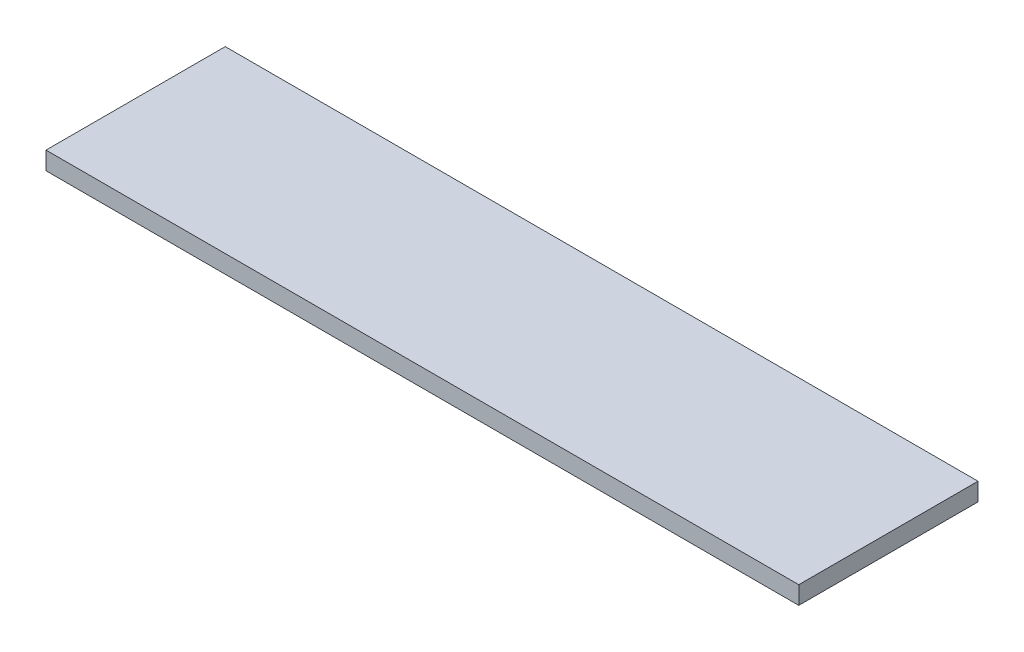
ISO-10303-21;
HEADER;
FILE_DESCRIPTION(('STEP AP214'),'2;1');
FILE_NAME('part.step','',(''),(''),'','','');
FILE_SCHEMA(('AUTOMOTIVE_DESIGN { 1 0 10303 214 1 1 1 1 }'));
ENDSEC;
DATA;
#1=APPLICATION_CONTEXT('core data for automotive mechanical design processes');
#2=APPLICATION_PROTOCOL_DEFINITION('international standard','automotive_design',2000,#1);
#3=PRODUCT_CONTEXT('',#1,'mechanical');
#4=PRODUCT('Part','Part','',(#3));
#5=PRODUCT_RELATED_PRODUCT_CATEGORY('part','',(#4));
#6=PRODUCT_DEFINITION_FORMATION('','',#4);
#7=PRODUCT_DEFINITION_CONTEXT('part definition',#1,'design');
#8=PRODUCT_DEFINITION('design','',#6,#7);
#9=PRODUCT_DEFINITION_SHAPE('','',#8);
#10=(LENGTH_UNIT() NAMED_UNIT(*) SI_UNIT(.MILLI.,.METRE.));
#11=(NAMED_UNIT(*) PLANE_ANGLE_UNIT() SI_UNIT($,.RADIAN.));
#12=(NAMED_UNIT(*) SI_UNIT($,.STERADIAN.) SOLID_ANGLE_UNIT());
#13=UNCERTAINTY_MEASURE_WITH_UNIT(LENGTH_MEASURE(1.E-05),#10,'distance_accuracy_value','');
#14=(GEOMETRIC_REPRESENTATION_CONTEXT(3) GLOBAL_UNCERTAINTY_ASSIGNED_CONTEXT((#13)) GLOBAL_UNIT_ASSIGNED_CONTEXT((#10,
#11,#12)) REPRESENTATION_CONTEXT('',''));
#15=CARTESIAN_POINT('',(0.,0.,0.));
#16=DIRECTION('',(0.,0.,1.));
#17=DIRECTION('',(1.,0.,0.));
#18=AXIS2_PLACEMENT_3D('',#15,#16,#17);
#19=CARTESIAN_POINT('',(0.,1.,0.));
#20=DIRECTION('',(1.,0.,0.));
#21=DIRECTION('',(0.,0.,-1.));
#22=AXIS2_PLACEMENT_3D('',#19,#20,#21);
#23=PLANE('',#22);
#24=DIRECTION('',(0.,0.,1.));
#25=VECTOR('',#24,1.);
#26=CARTESIAN_POINT('',(0.,0.,0.));
#27=LINE('',#26,#25);
#28=CARTESIAN_POINT('',(0.,0.,-10.));
#29=VERTEX_POINT('',#28);
#30=CARTESIAN_POINT('',(0.,0.,0.));
#31=VERTEX_POINT('',#30);
#32=EDGE_CURVE('E97',#29,#31,#27,.T.);
#33=ORIENTED_EDGE('',*,*,#32,.T.);
#34=DIRECTION('',(0.,-1.,0.));
#35=VECTOR('',#34,1.);
#36=CARTESIAN_POINT('',(0.,1.,0.));
#37=LINE('',#36,#35);
#38=CARTESIAN_POINT('',(0.,1.,0.));
#39=VERTEX_POINT('',#38);
#40=EDGE_CURVE('E11',#39,#31,#37,.T.);
#41=ORIENTED_EDGE('',*,*,#40,.F.);
#42=DIRECTION('',(0.,0.,1.));
#43=VECTOR('',#42,1.);
#44=CARTESIAN_POINT('',(0.,1.,0.));
#45=LINE('',#44,#43);
#46=CARTESIAN_POINT('',(0.,1.,-10.));
#47=VERTEX_POINT('',#46);
#48=EDGE_CURVE('E85',#47,#39,#45,.T.);
#49=ORIENTED_EDGE('',*,*,#48,.F.);
#50=DIRECTION('',(0.,-1.,0.));
#51=VECTOR('',#50,1.);
#52=CARTESIAN_POINT('',(0.,1.,-10.));
#53=LINE('',#52,#51);
#54=EDGE_CURVE('E93',#47,#29,#53,.T.);
#55=ORIENTED_EDGE('',*,*,#54,.T.);
#56=EDGE_LOOP('',(#33,#41,#49,#55));
#57=FACE_BOUND('',#56,.T.);
#58=ADVANCED_FACE('F34',(#57),#23,.F.);
#59=CARTESIAN_POINT('',(0.,1.,0.));
#60=DIRECTION('',(0.,0.,-1.));
#61=DIRECTION('',(-1.,0.,0.));
#62=AXIS2_PLACEMENT_3D('',#59,#60,#61);
#63=PLANE('',#62);
#64=DIRECTION('',(1.,0.,0.));
#65=VECTOR('',#64,1.);
#66=CARTESIAN_POINT('',(0.,0.,0.));
#67=LINE('',#66,#65);
#68=CARTESIAN_POINT('',(42.,0.,0.));
#69=VERTEX_POINT('',#68);
#70=EDGE_CURVE('E89',#31,#69,#67,.T.);
#71=ORIENTED_EDGE('',*,*,#70,.T.);
#72=DIRECTION('',(0.,-1.,0.));
#73=VECTOR('',#72,1.);
#74=CARTESIAN_POINT('',(42.,1.,0.));
#75=LINE('',#74,#73);
#76=CARTESIAN_POINT('',(42.,1.,0.));
#77=VERTEX_POINT('',#76);
#78=EDGE_CURVE('E42',#77,#69,#75,.T.);
#79=ORIENTED_EDGE('',*,*,#78,.F.);
#80=DIRECTION('',(1.,0.,0.));
#81=VECTOR('',#80,1.);
#82=CARTESIAN_POINT('',(0.,1.,0.));
#83=LINE('',#82,#81);
#84=EDGE_CURVE('E80',#39,#77,#83,.T.);
#85=ORIENTED_EDGE('',*,*,#84,.F.);
#86=ORIENTED_EDGE('',*,*,#40,.T.);
#87=EDGE_LOOP('',(#71,#79,#85,#86));
#88=FACE_BOUND('',#87,.T.);
#89=ADVANCED_FACE('F88',(#88),#63,.F.);
#90=CARTESIAN_POINT('',(42.,1.,0.));
#91=DIRECTION('',(-1.,0.,0.));
#92=DIRECTION('',(0.,0.,1.));
#93=AXIS2_PLACEMENT_3D('',#90,#91,#92);
#94=PLANE('',#93);
#95=DIRECTION('',(0.,0.,-1.));
#96=VECTOR('',#95,1.);
#97=CARTESIAN_POINT('',(42.,0.,0.));
#98=LINE('',#97,#96);
#99=CARTESIAN_POINT('',(42.,0.,-10.));
#100=VERTEX_POINT('',#99);
#101=EDGE_CURVE('E67',#69,#100,#98,.T.);
#102=ORIENTED_EDGE('',*,*,#101,.T.);
#103=DIRECTION('',(0.,-1.,0.));
#104=VECTOR('',#103,1.);
#105=CARTESIAN_POINT('',(42.,1.,-10.));
#106=LINE('',#105,#104);
#107=CARTESIAN_POINT('',(42.,1.,-10.));
#108=VERTEX_POINT('',#107);
#109=EDGE_CURVE('E90',#108,#100,#106,.T.);
#110=ORIENTED_EDGE('',*,*,#109,.F.);
#111=DIRECTION('',(0.,0.,-1.));
#112=VECTOR('',#111,1.);
#113=CARTESIAN_POINT('',(42.,1.,0.));
#114=LINE('',#113,#112);
#115=EDGE_CURVE('E83',#77,#108,#114,.T.);
#116=ORIENTED_EDGE('',*,*,#115,.F.);
#117=ORIENTED_EDGE('',*,*,#78,.T.);
#118=EDGE_LOOP('',(#102,#110,#116,#117));
#119=FACE_BOUND('',#118,.T.);
#120=ADVANCED_FACE('F91',(#119),#94,.F.);
#121=CARTESIAN_POINT('',(0.,1.,-10.));
#122=DIRECTION('',(0.,0.,1.));
#123=DIRECTION('',(1.,0.,0.));
#124=AXIS2_PLACEMENT_3D('',#121,#122,#123);
#125=PLANE('',#124);
#126=DIRECTION('',(-1.,0.,0.));
#127=VECTOR('',#126,1.);
#128=CARTESIAN_POINT('',(0.,0.,-10.));
#129=LINE('',#128,#127);
#130=EDGE_CURVE('E73',#100,#29,#129,.T.);
#131=ORIENTED_EDGE('',*,*,#130,.T.);
#132=ORIENTED_EDGE('',*,*,#54,.F.);
#133=DIRECTION('',(-1.,0.,0.));
#134=VECTOR('',#133,1.);
#135=CARTESIAN_POINT('',(0.,1.,-10.));
#136=LINE('',#135,#134);
#137=EDGE_CURVE('E50',#108,#47,#136,.T.);
#138=ORIENTED_EDGE('',*,*,#137,.F.);
#139=ORIENTED_EDGE('',*,*,#109,.T.);
#140=EDGE_LOOP('',(#131,#132,#138,#139));
#141=FACE_BOUND('',#140,.T.);
#142=ADVANCED_FACE('F104',(#141),#125,.F.);
#143=CARTESIAN_POINT('',(0.,1.,0.));
#144=DIRECTION('',(0.,-1.,0.));
#145=DIRECTION('',(0.,0.,-1.));
#146=AXIS2_PLACEMENT_3D('',#143,#144,#145);
#147=PLANE('',#146);
#148=ORIENTED_EDGE('',*,*,#48,.T.);
#149=ORIENTED_EDGE('',*,*,#84,.T.);
#150=ORIENTED_EDGE('',*,*,#115,.T.);
#151=ORIENTED_EDGE('',*,*,#137,.T.);
#152=EDGE_LOOP('',(#148,#149,#150,#151));
#153=FACE_BOUND('',#152,.T.);
#154=ADVANCED_FACE('F81',(#153),#147,.F.);
#155=CARTESIAN_POINT('',(0.,0.,0.));
#156=DIRECTION('',(0.,-1.,0.));
#157=DIRECTION('',(0.,0.,-1.));
#158=AXIS2_PLACEMENT_3D('',#155,#156,#157);
#159=PLANE('',#158);
#160=ORIENTED_EDGE('',*,*,#32,.F.);
#161=ORIENTED_EDGE('',*,*,#130,.F.);
#162=ORIENTED_EDGE('',*,*,#101,.F.);
#163=ORIENTED_EDGE('',*,*,#70,.F.);
#164=EDGE_LOOP('',(#160,#161,#162,#163));
#165=FACE_BOUND('',#164,.T.);
#166=ADVANCED_FACE('F107',(#165),#159,.T.);
#167=CLOSED_SHELL('',(#58,#89,#120,#142,#154,#166));
#168=MANIFOLD_SOLID_BREP('B2',#167);
#169=ADVANCED_BREP_SHAPE_REPRESENTATION('',(#18,#168),#14);
#170=SHAPE_DEFINITION_REPRESENTATION(#9,#169);
ENDSEC;
END-ISO-10303-21;
